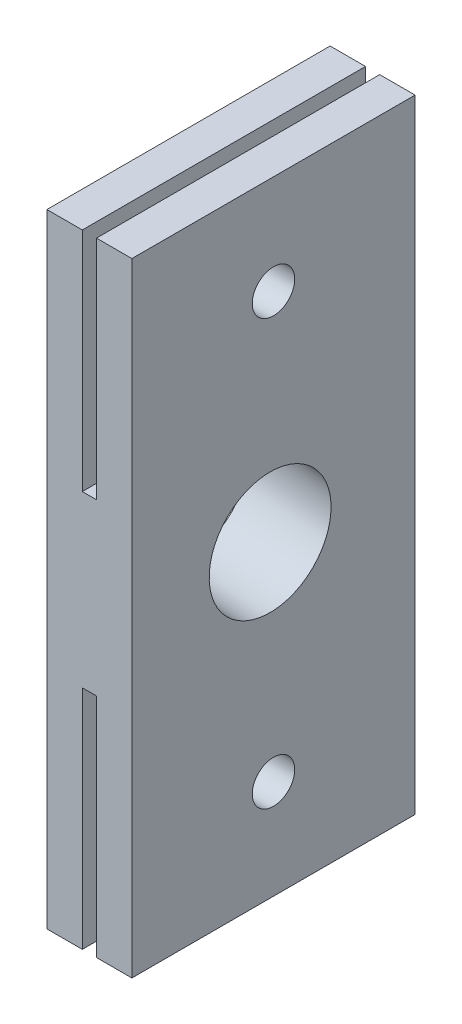
ISO-10303-21;
HEADER;
FILE_DESCRIPTION(('STEP AP214'),'2;1');
FILE_NAME('part.step','',(''),(''),'','','');
FILE_SCHEMA(('AUTOMOTIVE_DESIGN { 1 0 10303 214 1 1 1 1 }'));
ENDSEC;
DATA;
#1=APPLICATION_CONTEXT('core data for automotive mechanical design processes');
#2=APPLICATION_PROTOCOL_DEFINITION('international standard','automotive_design',2000,#1);
#3=PRODUCT_CONTEXT('',#1,'mechanical');
#4=PRODUCT('Part','Part','',(#3));
#5=PRODUCT_RELATED_PRODUCT_CATEGORY('part','',(#4));
#6=PRODUCT_DEFINITION_FORMATION('','',#4);
#7=PRODUCT_DEFINITION_CONTEXT('part definition',#1,'design');
#8=PRODUCT_DEFINITION('design','',#6,#7);
#9=PRODUCT_DEFINITION_SHAPE('','',#8);
#10=(LENGTH_UNIT() NAMED_UNIT(*) SI_UNIT(.MILLI.,.METRE.));
#11=(NAMED_UNIT(*) PLANE_ANGLE_UNIT() SI_UNIT($,.RADIAN.));
#12=(NAMED_UNIT(*) SI_UNIT($,.STERADIAN.) SOLID_ANGLE_UNIT());
#13=UNCERTAINTY_MEASURE_WITH_UNIT(LENGTH_MEASURE(1.E-05),#10,'distance_accuracy_value','');
#14=(GEOMETRIC_REPRESENTATION_CONTEXT(3) GLOBAL_UNCERTAINTY_ASSIGNED_CONTEXT((#13)) GLOBAL_UNIT_ASSIGNED_CONTEXT((#10,
#11,#12)) REPRESENTATION_CONTEXT('',''));
#15=CARTESIAN_POINT('',(0.,0.,0.));
#16=DIRECTION('',(0.,0.,1.));
#17=DIRECTION('',(1.,0.,0.));
#18=AXIS2_PLACEMENT_3D('',#15,#16,#17);
#19=CARTESIAN_POINT('',(2.5,22.,20.));
#20=DIRECTION('',(0.,-1.,0.));
#21=DIRECTION('',(0.,0.,-1.));
#22=AXIS2_PLACEMENT_3D('',#19,#20,#21);
#23=PLANE('',#22);
#24=DIRECTION('',(-1.,0.,0.));
#25=VECTOR('',#24,1.);
#26=CARTESIAN_POINT('',(2.5,22.,0.));
#27=LINE('',#26,#25);
#28=CARTESIAN_POINT('',(2.5,22.,0.));
#29=VERTEX_POINT('',#28);
#30=CARTESIAN_POINT('',(0.,22.,0.));
#31=VERTEX_POINT('',#30);
#32=EDGE_CURVE('E160',#29,#31,#27,.T.);
#33=ORIENTED_EDGE('',*,*,#32,.T.);
#34=DIRECTION('',(0.,0.,-1.));
#35=VECTOR('',#34,1.);
#36=CARTESIAN_POINT('',(0.,22.,20.));
#37=LINE('',#36,#35);
#38=CARTESIAN_POINT('',(0.,22.,20.));
#39=VERTEX_POINT('',#38);
#40=EDGE_CURVE('E12',#39,#31,#37,.T.);
#41=ORIENTED_EDGE('',*,*,#40,.F.);
#42=DIRECTION('',(-1.,0.,0.));
#43=VECTOR('',#42,1.);
#44=CARTESIAN_POINT('',(2.5,22.,20.));
#45=LINE('',#44,#43);
#46=CARTESIAN_POINT('',(2.5,22.,20.));
#47=VERTEX_POINT('',#46);
#48=EDGE_CURVE('E183',#47,#39,#45,.T.);
#49=ORIENTED_EDGE('',*,*,#48,.F.);
#50=DIRECTION('',(0.,0.,-1.));
#51=VECTOR('',#50,1.);
#52=CARTESIAN_POINT('',(2.5,22.,20.));
#53=LINE('',#52,#51);
#54=EDGE_CURVE('E156',#47,#29,#53,.T.);
#55=ORIENTED_EDGE('',*,*,#54,.T.);
#56=EDGE_LOOP('',(#33,#41,#49,#55));
#57=FACE_BOUND('',#56,.T.);
#58=ADVANCED_FACE('F37',(#57),#23,.F.);
#59=CARTESIAN_POINT('',(0.,22.,20.));
#60=DIRECTION('',(1.,0.,0.));
#61=DIRECTION('',(0.,0.,-1.));
#62=AXIS2_PLACEMENT_3D('',#59,#60,#61);
#63=PLANE('',#62);
#64=CARTESIAN_POINT('',(0.,0.,10.0073719300605));
#65=DIRECTION('',(1.,0.,0.));
#66=DIRECTION('',(0.,0.706846192152381,-0.707367274221588));
#67=AXIS2_PLACEMENT_3D('',#64,#65,#66);
#68=ELLIPSE('',#67,4.3063421967022,4.3);
#69=CARTESIAN_POINT('',(0.,3.04392158384407,6.96120638851385));
#70=VERTEX_POINT('',#69);
#71=EDGE_CURVE('E41',#70,#70,#68,.F.);
#72=ORIENTED_EDGE('',*,*,#71,.F.);
#73=EDGE_LOOP('',(#72));
#74=FACE_BOUND('',#73,.T.);
#75=CARTESIAN_POINT('',(0.,-15.,10.));
#76=DIRECTION('',(-1.,0.,0.));
#77=DIRECTION('',(0.,0.,1.));
#78=AXIS2_PLACEMENT_3D('',#75,#76,#77);
#79=CIRCLE('',#78,1.5);
#80=CARTESIAN_POINT('',(0.,-15.,11.5));
#81=VERTEX_POINT('',#80);
#82=EDGE_CURVE('E212',#81,#81,#79,.T.);
#83=ORIENTED_EDGE('',*,*,#82,.F.);
#84=EDGE_LOOP('',(#83));
#85=FACE_BOUND('',#84,.T.);
#86=CARTESIAN_POINT('',(0.,15.,10.));
#87=DIRECTION('',(-1.,0.,0.));
#88=DIRECTION('',(0.,0.,1.));
#89=AXIS2_PLACEMENT_3D('',#86,#87,#88);
#90=CIRCLE('',#89,1.5);
#91=CARTESIAN_POINT('',(0.,15.,11.5));
#92=VERTEX_POINT('',#91);
#93=EDGE_CURVE('E231',#92,#92,#90,.T.);
#94=ORIENTED_EDGE('',*,*,#93,.F.);
#95=EDGE_LOOP('',(#94));
#96=FACE_BOUND('',#95,.T.);
#97=DIRECTION('',(0.,-1.,0.));
#98=VECTOR('',#97,1.);
#99=CARTESIAN_POINT('',(0.,22.,0.));
#100=LINE('',#99,#98);
#101=CARTESIAN_POINT('',(0.,-22.,0.));
#102=VERTEX_POINT('',#101);
#103=EDGE_CURVE('E163',#31,#102,#100,.T.);
#104=ORIENTED_EDGE('',*,*,#103,.T.);
#105=DIRECTION('',(0.,0.,-1.));
#106=VECTOR('',#105,1.);
#107=CARTESIAN_POINT('',(0.,-22.,20.));
#108=LINE('',#107,#106);
#109=CARTESIAN_POINT('',(0.,-22.,20.));
#110=VERTEX_POINT('',#109);
#111=EDGE_CURVE('E47',#110,#102,#108,.T.);
#112=ORIENTED_EDGE('',*,*,#111,.F.);
#113=DIRECTION('',(0.,-1.,0.));
#114=VECTOR('',#113,1.);
#115=CARTESIAN_POINT('',(0.,22.,20.));
#116=LINE('',#115,#114);
#117=EDGE_CURVE('E111',#39,#110,#116,.T.);
#118=ORIENTED_EDGE('',*,*,#117,.F.);
#119=ORIENTED_EDGE('',*,*,#40,.T.);
#120=EDGE_LOOP('',(#104,#112,#118,#119));
#121=FACE_BOUND('',#120,.T.);
#122=ADVANCED_FACE('F222',(#74,#85,#96,#121),#63,.F.);
#123=CARTESIAN_POINT('',(0.,-22.,20.));
#124=DIRECTION('',(0.,1.,0.));
#125=DIRECTION('',(0.,0.,1.));
#126=AXIS2_PLACEMENT_3D('',#123,#124,#125);
#127=PLANE('',#126);
#128=DIRECTION('',(1.,0.,0.));
#129=VECTOR('',#128,1.);
#130=CARTESIAN_POINT('',(0.,-22.,0.));
#131=LINE('',#130,#129);
#132=CARTESIAN_POINT('',(2.5,-22.,0.));
#133=VERTEX_POINT('',#132);
#134=EDGE_CURVE('E166',#102,#133,#131,.T.);
#135=ORIENTED_EDGE('',*,*,#134,.T.);
#136=DIRECTION('',(0.,0.,-1.));
#137=VECTOR('',#136,1.);
#138=CARTESIAN_POINT('',(2.5,-22.,20.));
#139=LINE('',#138,#137);
#140=CARTESIAN_POINT('',(2.5,-22.,20.));
#141=VERTEX_POINT('',#140);
#142=EDGE_CURVE('E202',#141,#133,#139,.T.);
#143=ORIENTED_EDGE('',*,*,#142,.F.);
#144=DIRECTION('',(1.,0.,0.));
#145=VECTOR('',#144,1.);
#146=CARTESIAN_POINT('',(0.,-22.,20.));
#147=LINE('',#146,#145);
#148=EDGE_CURVE('E239',#110,#141,#147,.T.);
#149=ORIENTED_EDGE('',*,*,#148,.F.);
#150=ORIENTED_EDGE('',*,*,#111,.T.);
#151=EDGE_LOOP('',(#135,#143,#149,#150));
#152=FACE_BOUND('',#151,.T.);
#153=ADVANCED_FACE('F225',(#152),#127,.F.);
#154=CARTESIAN_POINT('',(2.5,-22.,20.));
#155=DIRECTION('',(-1.,0.,0.));
#156=DIRECTION('',(0.,0.,1.));
#157=AXIS2_PLACEMENT_3D('',#154,#155,#156);
#158=PLANE('',#157);
#159=CARTESIAN_POINT('',(2.5,-15.,10.));
#160=DIRECTION('',(-1.,0.,0.));
#161=DIRECTION('',(0.,0.,1.));
#162=AXIS2_PLACEMENT_3D('',#159,#160,#161);
#163=CIRCLE('',#162,1.5);
#164=CARTESIAN_POINT('',(2.5,-15.,11.5));
#165=VERTEX_POINT('',#164);
#166=EDGE_CURVE('E322',#165,#165,#163,.T.);
#167=ORIENTED_EDGE('',*,*,#166,.T.);
#168=EDGE_LOOP('',(#167));
#169=FACE_BOUND('',#168,.T.);
#170=DIRECTION('',(0.,1.,0.));
#171=VECTOR('',#170,1.);
#172=CARTESIAN_POINT('',(2.5,-22.,0.));
#173=LINE('',#172,#171);
#174=CARTESIAN_POINT('',(2.5,-6.,0.));
#175=VERTEX_POINT('',#174);
#176=EDGE_CURVE('E168',#133,#175,#173,.T.);
#177=ORIENTED_EDGE('',*,*,#176,.T.);
#178=DIRECTION('',(0.,0.,-1.));
#179=VECTOR('',#178,1.);
#180=CARTESIAN_POINT('',(2.5,-6.,20.));
#181=LINE('',#180,#179);
#182=CARTESIAN_POINT('',(2.5,-6.,20.));
#183=VERTEX_POINT('',#182);
#184=EDGE_CURVE('E199',#183,#175,#181,.T.);
#185=ORIENTED_EDGE('',*,*,#184,.F.);
#186=DIRECTION('',(0.,1.,0.));
#187=VECTOR('',#186,1.);
#188=CARTESIAN_POINT('',(2.5,-22.,20.));
#189=LINE('',#188,#187);
#190=EDGE_CURVE('E255',#141,#183,#189,.T.);
#191=ORIENTED_EDGE('',*,*,#190,.F.);
#192=ORIENTED_EDGE('',*,*,#142,.T.);
#193=EDGE_LOOP('',(#177,#185,#191,#192));
#194=FACE_BOUND('',#193,.T.);
#195=ADVANCED_FACE('F246',(#169,#194),#158,.F.);
#196=CARTESIAN_POINT('',(2.5,-6.,20.));
#197=DIRECTION('',(0.,1.,0.));
#198=DIRECTION('',(0.,0.,1.));
#199=AXIS2_PLACEMENT_3D('',#196,#197,#198);
#200=PLANE('',#199);
#201=DIRECTION('',(1.,0.,0.));
#202=VECTOR('',#201,1.);
#203=CARTESIAN_POINT('',(2.5,-6.,0.));
#204=LINE('',#203,#202);
#205=CARTESIAN_POINT('',(3.5,-6.,0.));
#206=VERTEX_POINT('',#205);
#207=EDGE_CURVE('E170',#175,#206,#204,.T.);
#208=ORIENTED_EDGE('',*,*,#207,.T.);
#209=DIRECTION('',(0.,0.,-1.));
#210=VECTOR('',#209,1.);
#211=CARTESIAN_POINT('',(3.5,-6.,20.));
#212=LINE('',#211,#210);
#213=CARTESIAN_POINT('',(3.5,-6.,20.));
#214=VERTEX_POINT('',#213);
#215=EDGE_CURVE('E196',#214,#206,#212,.T.);
#216=ORIENTED_EDGE('',*,*,#215,.F.);
#217=DIRECTION('',(1.,0.,0.));
#218=VECTOR('',#217,1.);
#219=CARTESIAN_POINT('',(2.5,-6.,20.));
#220=LINE('',#219,#218);
#221=EDGE_CURVE('E252',#183,#214,#220,.T.);
#222=ORIENTED_EDGE('',*,*,#221,.F.);
#223=ORIENTED_EDGE('',*,*,#184,.T.);
#224=EDGE_LOOP('',(#208,#216,#222,#223));
#225=FACE_BOUND('',#224,.T.);
#226=ADVANCED_FACE('F250',(#225),#200,.F.);
#227=CARTESIAN_POINT('',(3.5,-6.,20.));
#228=DIRECTION('',(1.,0.,0.));
#229=DIRECTION('',(0.,1.,0.));
#230=AXIS2_PLACEMENT_3D('',#227,#228,#229);
#231=PLANE('',#230);
#232=CARTESIAN_POINT('',(3.5,-15.,10.));
#233=DIRECTION('',(1.,0.,0.));
#234=DIRECTION('',(0.,1.,0.));
#235=AXIS2_PLACEMENT_3D('',#232,#233,#234);
#236=CIRCLE('',#235,1.5);
#237=CARTESIAN_POINT('',(3.5,-13.5,10.));
#238=VERTEX_POINT('',#237);
#239=EDGE_CURVE('E327',#238,#238,#236,.T.);
#240=ORIENTED_EDGE('',*,*,#239,.T.);
#241=EDGE_LOOP('',(#240));
#242=FACE_BOUND('',#241,.T.);
#243=DIRECTION('',(0.,-1.,0.));
#244=VECTOR('',#243,1.);
#245=CARTESIAN_POINT('',(3.5,-6.,0.));
#246=LINE('',#245,#244);
#247=CARTESIAN_POINT('',(3.50000000000001,-22.,0.));
#248=VERTEX_POINT('',#247);
#249=EDGE_CURVE('E172',#206,#248,#246,.T.);
#250=ORIENTED_EDGE('',*,*,#249,.T.);
#251=DIRECTION('',(0.,0.,-1.));
#252=VECTOR('',#251,1.);
#253=CARTESIAN_POINT('',(3.50000000000001,-22.,20.));
#254=LINE('',#253,#252);
#255=CARTESIAN_POINT('',(3.50000000000001,-22.,20.));
#256=VERTEX_POINT('',#255);
#257=EDGE_CURVE('E193',#256,#248,#254,.T.);
#258=ORIENTED_EDGE('',*,*,#257,.F.);
#259=DIRECTION('',(0.,-1.,0.));
#260=VECTOR('',#259,1.);
#261=CARTESIAN_POINT('',(3.5,-6.,20.));
#262=LINE('',#261,#260);
#263=EDGE_CURVE('E254',#214,#256,#262,.T.);
#264=ORIENTED_EDGE('',*,*,#263,.F.);
#265=ORIENTED_EDGE('',*,*,#215,.T.);
#266=EDGE_LOOP('',(#250,#258,#264,#265));
#267=FACE_BOUND('',#266,.T.);
#268=ADVANCED_FACE('F298',(#242,#267),#231,.F.);
#269=CARTESIAN_POINT('',(3.50000000000001,-22.,20.));
#270=DIRECTION('',(0.,1.,0.));
#271=DIRECTION('',(0.,0.,1.));
#272=AXIS2_PLACEMENT_3D('',#269,#270,#271);
#273=PLANE('',#272);
#274=DIRECTION('',(1.,0.,0.));
#275=VECTOR('',#274,1.);
#276=CARTESIAN_POINT('',(3.50000000000001,-22.,0.));
#277=LINE('',#276,#275);
#278=CARTESIAN_POINT('',(6.00000000000001,-22.,0.));
#279=VERTEX_POINT('',#278);
#280=EDGE_CURVE('E174',#248,#279,#277,.T.);
#281=ORIENTED_EDGE('',*,*,#280,.T.);
#282=DIRECTION('',(0.,0.,-1.));
#283=VECTOR('',#282,1.);
#284=CARTESIAN_POINT('',(6.00000000000001,-22.,20.));
#285=LINE('',#284,#283);
#286=CARTESIAN_POINT('',(6.00000000000001,-22.,20.));
#287=VERTEX_POINT('',#286);
#288=EDGE_CURVE('E190',#287,#279,#285,.T.);
#289=ORIENTED_EDGE('',*,*,#288,.F.);
#290=DIRECTION('',(1.,0.,0.));
#291=VECTOR('',#290,1.);
#292=CARTESIAN_POINT('',(3.50000000000001,-22.,20.));
#293=LINE('',#292,#291);
#294=EDGE_CURVE('E257',#256,#287,#293,.T.);
#295=ORIENTED_EDGE('',*,*,#294,.F.);
#296=ORIENTED_EDGE('',*,*,#257,.T.);
#297=EDGE_LOOP('',(#281,#289,#295,#296));
#298=FACE_BOUND('',#297,.T.);
#299=ADVANCED_FACE('F301',(#298),#273,.F.);
#300=CARTESIAN_POINT('',(6.00000000000001,-22.,20.));
#301=DIRECTION('',(-1.,0.,0.));
#302=DIRECTION('',(0.,0.,1.));
#303=AXIS2_PLACEMENT_3D('',#300,#301,#302);
#304=PLANE('',#303);
#305=CARTESIAN_POINT('',(6.00000000000001,-0.230428862694206,10.2379706633007));
#306=DIRECTION('',(-1.,0.,0.));
#307=DIRECTION('',(0.,0.706846192152381,-0.707367274221588));
#308=AXIS2_PLACEMENT_3D('',#305,#306,#307);
#309=ELLIPSE('',#308,4.3063421967022,4.3);
#310=CARTESIAN_POINT('',(6.00000000000001,2.81349272114986,7.19180512175402));
#311=VERTEX_POINT('',#310);
#312=EDGE_CURVE('E210',#311,#311,#309,.T.);
#313=ORIENTED_EDGE('',*,*,#312,.T.);
#314=EDGE_LOOP('',(#313));
#315=FACE_BOUND('',#314,.T.);
#316=CARTESIAN_POINT('',(6.00000000000001,-15.,10.));
#317=DIRECTION('',(-1.,0.,0.));
#318=DIRECTION('',(0.,0.,1.));
#319=AXIS2_PLACEMENT_3D('',#316,#317,#318);
#320=CIRCLE('',#319,1.5);
#321=CARTESIAN_POINT('',(6.00000000000001,-15.,11.5));
#322=VERTEX_POINT('',#321);
#323=EDGE_CURVE('E216',#322,#322,#320,.T.);
#324=ORIENTED_EDGE('',*,*,#323,.T.);
#325=EDGE_LOOP('',(#324));
#326=FACE_BOUND('',#325,.T.);
#327=CARTESIAN_POINT('',(6.00000000000001,15.,10.));
#328=DIRECTION('',(-1.,0.,0.));
#329=DIRECTION('',(0.,0.,1.));
#330=AXIS2_PLACEMENT_3D('',#327,#328,#329);
#331=CIRCLE('',#330,1.5);
#332=CARTESIAN_POINT('',(6.00000000000001,15.,11.5));
#333=VERTEX_POINT('',#332);
#334=EDGE_CURVE('E209',#333,#333,#331,.T.);
#335=ORIENTED_EDGE('',*,*,#334,.T.);
#336=EDGE_LOOP('',(#335));
#337=FACE_BOUND('',#336,.T.);
#338=DIRECTION('',(0.,1.,0.));
#339=VECTOR('',#338,1.);
#340=CARTESIAN_POINT('',(6.00000000000001,-22.,0.));
#341=LINE('',#340,#339);
#342=CARTESIAN_POINT('',(6.00000000000001,22.,0.));
#343=VERTEX_POINT('',#342);
#344=EDGE_CURVE('E176',#279,#343,#341,.T.);
#345=ORIENTED_EDGE('',*,*,#344,.T.);
#346=DIRECTION('',(0.,0.,-1.));
#347=VECTOR('',#346,1.);
#348=CARTESIAN_POINT('',(6.00000000000001,22.,20.));
#349=LINE('',#348,#347);
#350=CARTESIAN_POINT('',(6.00000000000001,22.,20.));
#351=VERTEX_POINT('',#350);
#352=EDGE_CURVE('E187',#351,#343,#349,.T.);
#353=ORIENTED_EDGE('',*,*,#352,.F.);
#354=DIRECTION('',(0.,1.,0.));
#355=VECTOR('',#354,1.);
#356=CARTESIAN_POINT('',(6.00000000000001,-22.,20.));
#357=LINE('',#356,#355);
#358=EDGE_CURVE('E263',#287,#351,#357,.T.);
#359=ORIENTED_EDGE('',*,*,#358,.F.);
#360=ORIENTED_EDGE('',*,*,#288,.T.);
#361=EDGE_LOOP('',(#345,#353,#359,#360));
#362=FACE_BOUND('',#361,.T.);
#363=ADVANCED_FACE('F269',(#315,#326,#337,#362),#304,.F.);
#364=CARTESIAN_POINT('',(6.00000000000001,22.,20.));
#365=DIRECTION('',(0.,-1.,0.));
#366=DIRECTION('',(0.,0.,-1.));
#367=AXIS2_PLACEMENT_3D('',#364,#365,#366);
#368=PLANE('',#367);
#369=DIRECTION('',(-1.,0.,0.));
#370=VECTOR('',#369,1.);
#371=CARTESIAN_POINT('',(6.00000000000001,22.,0.));
#372=LINE('',#371,#370);
#373=CARTESIAN_POINT('',(3.50000000000001,22.,0.));
#374=VERTEX_POINT('',#373);
#375=EDGE_CURVE('E178',#343,#374,#372,.T.);
#376=ORIENTED_EDGE('',*,*,#375,.T.);
#377=DIRECTION('',(0.,0.,-1.));
#378=VECTOR('',#377,1.);
#379=CARTESIAN_POINT('',(3.50000000000001,22.,20.));
#380=LINE('',#379,#378);
#381=CARTESIAN_POINT('',(3.50000000000001,22.,20.));
#382=VERTEX_POINT('',#381);
#383=EDGE_CURVE('E151',#382,#374,#380,.T.);
#384=ORIENTED_EDGE('',*,*,#383,.F.);
#385=DIRECTION('',(-1.,0.,0.));
#386=VECTOR('',#385,1.);
#387=CARTESIAN_POINT('',(6.00000000000001,22.,20.));
#388=LINE('',#387,#386);
#389=EDGE_CURVE('E142',#351,#382,#388,.T.);
#390=ORIENTED_EDGE('',*,*,#389,.F.);
#391=ORIENTED_EDGE('',*,*,#352,.T.);
#392=EDGE_LOOP('',(#376,#384,#390,#391));
#393=FACE_BOUND('',#392,.T.);
#394=ADVANCED_FACE('F273',(#393),#368,.F.);
#395=CARTESIAN_POINT('',(3.50000000000001,22.,20.));
#396=DIRECTION('',(1.,0.,0.));
#397=DIRECTION('',(0.,1.,0.));
#398=AXIS2_PLACEMENT_3D('',#395,#396,#397);
#399=PLANE('',#398);
#400=CARTESIAN_POINT('',(3.5,15.,10.));
#401=DIRECTION('',(1.,0.,0.));
#402=DIRECTION('',(0.,1.,0.));
#403=AXIS2_PLACEMENT_3D('',#400,#401,#402);
#404=CIRCLE('',#403,1.5);
#405=CARTESIAN_POINT('',(3.5,16.5,10.));
#406=VERTEX_POINT('',#405);
#407=EDGE_CURVE('E164',#406,#406,#404,.T.);
#408=ORIENTED_EDGE('',*,*,#407,.T.);
#409=EDGE_LOOP('',(#408));
#410=FACE_BOUND('',#409,.T.);
#411=DIRECTION('',(0.,-1.,0.));
#412=VECTOR('',#411,1.);
#413=CARTESIAN_POINT('',(3.50000000000001,22.,0.));
#414=LINE('',#413,#412);
#415=CARTESIAN_POINT('',(3.5,6.,0.));
#416=VERTEX_POINT('',#415);
#417=EDGE_CURVE('E150',#374,#416,#414,.T.);
#418=ORIENTED_EDGE('',*,*,#417,.T.);
#419=DIRECTION('',(0.,0.,-1.));
#420=VECTOR('',#419,1.);
#421=CARTESIAN_POINT('',(3.5,6.,20.));
#422=LINE('',#421,#420);
#423=CARTESIAN_POINT('',(3.5,6.,20.));
#424=VERTEX_POINT('',#423);
#425=EDGE_CURVE('E147',#424,#416,#422,.T.);
#426=ORIENTED_EDGE('',*,*,#425,.F.);
#427=DIRECTION('',(0.,-1.,0.));
#428=VECTOR('',#427,1.);
#429=CARTESIAN_POINT('',(3.50000000000001,22.,20.));
#430=LINE('',#429,#428);
#431=EDGE_CURVE('E136',#382,#424,#430,.T.);
#432=ORIENTED_EDGE('',*,*,#431,.F.);
#433=ORIENTED_EDGE('',*,*,#383,.T.);
#434=EDGE_LOOP('',(#418,#426,#432,#433));
#435=FACE_BOUND('',#434,.T.);
#436=ADVANCED_FACE('F148',(#410,#435),#399,.F.);
#437=CARTESIAN_POINT('',(3.5,6.,20.));
#438=DIRECTION('',(0.,-1.,0.));
#439=DIRECTION('',(0.,0.,-1.));
#440=AXIS2_PLACEMENT_3D('',#437,#438,#439);
#441=PLANE('',#440);
#442=DIRECTION('',(-1.,0.,0.));
#443=VECTOR('',#442,1.);
#444=CARTESIAN_POINT('',(3.5,6.,0.));
#445=LINE('',#444,#443);
#446=CARTESIAN_POINT('',(2.5,6.,0.));
#447=VERTEX_POINT('',#446);
#448=EDGE_CURVE('E97',#416,#447,#445,.T.);
#449=ORIENTED_EDGE('',*,*,#448,.T.);
#450=DIRECTION('',(0.,0.,-1.));
#451=VECTOR('',#450,1.);
#452=CARTESIAN_POINT('',(2.5,6.,20.));
#453=LINE('',#452,#451);
#454=CARTESIAN_POINT('',(2.5,6.,20.));
#455=VERTEX_POINT('',#454);
#456=EDGE_CURVE('E152',#455,#447,#453,.T.);
#457=ORIENTED_EDGE('',*,*,#456,.F.);
#458=DIRECTION('',(-1.,0.,0.));
#459=VECTOR('',#458,1.);
#460=CARTESIAN_POINT('',(3.5,6.,20.));
#461=LINE('',#460,#459);
#462=EDGE_CURVE('E140',#424,#455,#461,.T.);
#463=ORIENTED_EDGE('',*,*,#462,.F.);
#464=ORIENTED_EDGE('',*,*,#425,.T.);
#465=EDGE_LOOP('',(#449,#457,#463,#464));
#466=FACE_BOUND('',#465,.T.);
#467=ADVANCED_FACE('F154',(#466),#441,.F.);
#468=CARTESIAN_POINT('',(2.5,6.,20.));
#469=DIRECTION('',(-1.,0.,0.));
#470=DIRECTION('',(0.,0.,1.));
#471=AXIS2_PLACEMENT_3D('',#468,#469,#470);
#472=PLANE('',#471);
#473=CARTESIAN_POINT('',(2.5,15.,10.));
#474=DIRECTION('',(-1.,0.,0.));
#475=DIRECTION('',(0.,0.,1.));
#476=AXIS2_PLACEMENT_3D('',#473,#474,#475);
#477=CIRCLE('',#476,1.5);
#478=CARTESIAN_POINT('',(2.5,15.,11.5));
#479=VERTEX_POINT('',#478);
#480=EDGE_CURVE('E207',#479,#479,#477,.T.);
#481=ORIENTED_EDGE('',*,*,#480,.T.);
#482=EDGE_LOOP('',(#481));
#483=FACE_BOUND('',#482,.T.);
#484=DIRECTION('',(0.,1.,0.));
#485=VECTOR('',#484,1.);
#486=CARTESIAN_POINT('',(2.5,6.,0.));
#487=LINE('',#486,#485);
#488=EDGE_CURVE('E103',#447,#29,#487,.T.);
#489=ORIENTED_EDGE('',*,*,#488,.T.);
#490=ORIENTED_EDGE('',*,*,#54,.F.);
#491=DIRECTION('',(0.,1.,0.));
#492=VECTOR('',#491,1.);
#493=CARTESIAN_POINT('',(2.5,6.,20.));
#494=LINE('',#493,#492);
#495=EDGE_CURVE('E56',#455,#47,#494,.T.);
#496=ORIENTED_EDGE('',*,*,#495,.F.);
#497=ORIENTED_EDGE('',*,*,#456,.T.);
#498=EDGE_LOOP('',(#489,#490,#496,#497));
#499=FACE_BOUND('',#498,.T.);
#500=ADVANCED_FACE('F276',(#483,#499),#472,.F.);
#501=CARTESIAN_POINT('',(0.,0.,20.));
#502=DIRECTION('',(0.,0.,1.));
#503=DIRECTION('',(1.,0.,0.));
#504=AXIS2_PLACEMENT_3D('',#501,#502,#503);
#505=PLANE('',#504);
#506=ORIENTED_EDGE('',*,*,#48,.T.);
#507=ORIENTED_EDGE('',*,*,#117,.T.);
#508=ORIENTED_EDGE('',*,*,#148,.T.);
#509=ORIENTED_EDGE('',*,*,#190,.T.);
#510=ORIENTED_EDGE('',*,*,#221,.T.);
#511=ORIENTED_EDGE('',*,*,#263,.T.);
#512=ORIENTED_EDGE('',*,*,#294,.T.);
#513=ORIENTED_EDGE('',*,*,#358,.T.);
#514=ORIENTED_EDGE('',*,*,#389,.T.);
#515=ORIENTED_EDGE('',*,*,#431,.T.);
#516=ORIENTED_EDGE('',*,*,#462,.T.);
#517=ORIENTED_EDGE('',*,*,#495,.T.);
#518=EDGE_LOOP('',(#506,#507,#508,#509,#510,#511,#512,#513,#514,#515,#516,#517));
#519=FACE_BOUND('',#518,.T.);
#520=ADVANCED_FACE('F138',(#519),#505,.T.);
#521=CARTESIAN_POINT('',(0.,0.,0.));
#522=DIRECTION('',(0.,0.,1.));
#523=DIRECTION('',(1.,0.,0.));
#524=AXIS2_PLACEMENT_3D('',#521,#522,#523);
#525=PLANE('',#524);
#526=ORIENTED_EDGE('',*,*,#32,.F.);
#527=ORIENTED_EDGE('',*,*,#488,.F.);
#528=ORIENTED_EDGE('',*,*,#448,.F.);
#529=ORIENTED_EDGE('',*,*,#417,.F.);
#530=ORIENTED_EDGE('',*,*,#375,.F.);
#531=ORIENTED_EDGE('',*,*,#344,.F.);
#532=ORIENTED_EDGE('',*,*,#280,.F.);
#533=ORIENTED_EDGE('',*,*,#249,.F.);
#534=ORIENTED_EDGE('',*,*,#207,.F.);
#535=ORIENTED_EDGE('',*,*,#176,.F.);
#536=ORIENTED_EDGE('',*,*,#134,.F.);
#537=ORIENTED_EDGE('',*,*,#103,.F.);
#538=EDGE_LOOP('',(#526,#527,#528,#529,#530,#531,#532,#533,#534,#535,#536,#537));
#539=FACE_BOUND('',#538,.T.);
#540=ADVANCED_FACE('F241',(#539),#525,.F.);
#541=CARTESIAN_POINT('',(6.00000000000001,15.,10.));
#542=DIRECTION('',(-1.,0.,0.));
#543=DIRECTION('',(0.,0.,1.));
#544=AXIS2_PLACEMENT_3D('',#541,#542,#543);
#545=CYLINDRICAL_SURFACE('',#544,1.5);
#546=ORIENTED_EDGE('',*,*,#93,.T.);
#547=EDGE_LOOP('',(#546));
#548=FACE_BOUND('',#547,.T.);
#549=ORIENTED_EDGE('',*,*,#480,.F.);
#550=EDGE_LOOP('',(#549));
#551=FACE_BOUND('',#550,.T.);
#552=ADVANCED_FACE('F350',(#548,#551),#545,.F.);
#553=ORIENTED_EDGE('',*,*,#334,.F.);
#554=EDGE_LOOP('',(#553));
#555=FACE_BOUND('',#554,.T.);
#556=ORIENTED_EDGE('',*,*,#407,.F.);
#557=EDGE_LOOP('',(#556));
#558=FACE_BOUND('',#557,.T.);
#559=ADVANCED_FACE('F339',(#555,#558),#545,.F.);
#560=CARTESIAN_POINT('',(6.00000000000001,-15.,10.));
#561=DIRECTION('',(-1.,0.,0.));
#562=DIRECTION('',(0.,0.,1.));
#563=AXIS2_PLACEMENT_3D('',#560,#561,#562);
#564=CYLINDRICAL_SURFACE('',#563,1.5);
#565=ORIENTED_EDGE('',*,*,#323,.F.);
#566=EDGE_LOOP('',(#565));
#567=FACE_BOUND('',#566,.T.);
#568=ORIENTED_EDGE('',*,*,#239,.F.);
#569=EDGE_LOOP('',(#568));
#570=FACE_BOUND('',#569,.T.);
#571=ADVANCED_FACE('F335',(#567,#570),#564,.F.);
#572=ORIENTED_EDGE('',*,*,#82,.T.);
#573=EDGE_LOOP('',(#572));
#574=FACE_BOUND('',#573,.T.);
#575=ORIENTED_EDGE('',*,*,#166,.F.);
#576=EDGE_LOOP('',(#575));
#577=FACE_BOUND('',#576,.T.);
#578=ADVANCED_FACE('F338',(#574,#577),#564,.F.);
#579=CARTESIAN_POINT('',(5.60768096162553,-0.215361924389887,10.2228926177548));
#580=DIRECTION('',(-0.998527242747441,0.0383482494859122,-0.0383765195472275));
#581=DIRECTION('',(-0.0383482494859122,0.00147275725255866,0.999263350047144));
#582=AXIS2_PLACEMENT_3D('',#579,#580,#581);
#583=CYLINDRICAL_SURFACE('',#582,4.3);
#584=ORIENTED_EDGE('',*,*,#312,.F.);
#585=EDGE_LOOP('',(#584));
#586=FACE_BOUND('',#585,.T.);
#587=ORIENTED_EDGE('',*,*,#71,.T.);
#588=EDGE_LOOP('',(#587));
#589=FACE_BOUND('',#588,.T.);
#590=ADVANCED_FACE('F39',(#586,#589),#583,.F.);
#591=CLOSED_SHELL('',(#58,#122,#153,#195,#226,#268,#299,#363,#394,#436,#467,#500,#520,#540,#552,
#559,#571,#578,#590));
#592=MANIFOLD_SOLID_BREP('B2',#591);
#593=ADVANCED_BREP_SHAPE_REPRESENTATION('',(#18,#592),#14);
#594=SHAPE_DEFINITION_REPRESENTATION(#9,#593);
ENDSEC;
END-ISO-10303-21;
